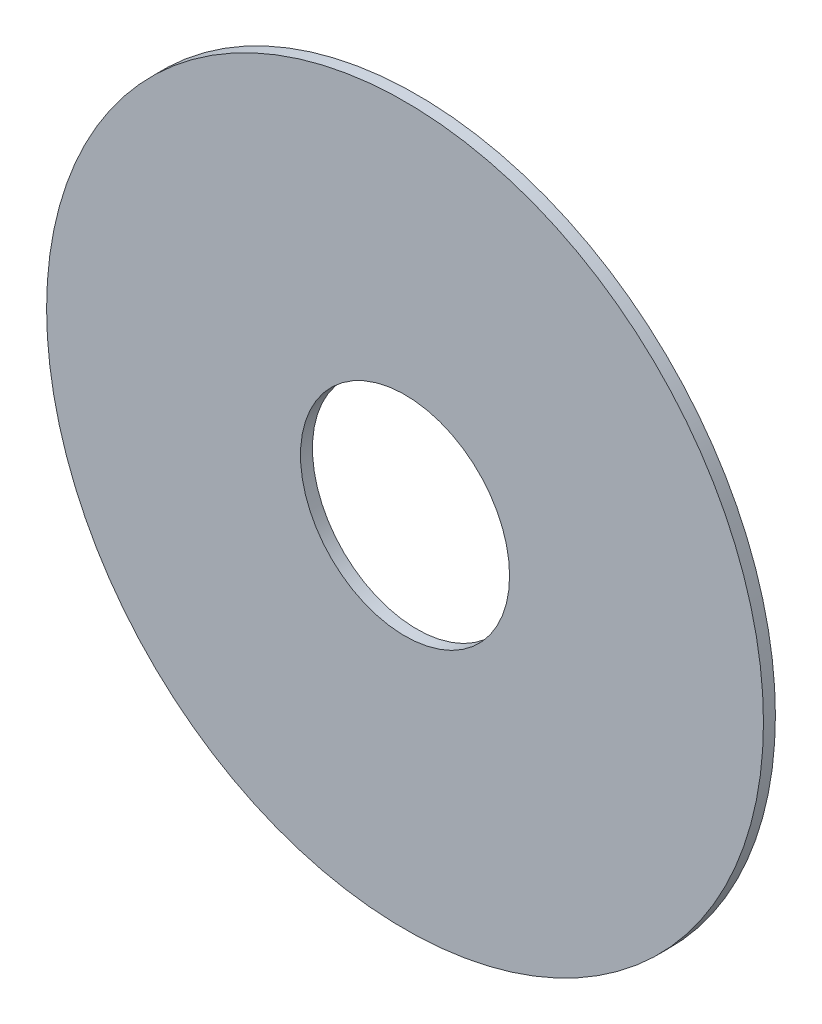
ISO-10303-21;
HEADER;
FILE_DESCRIPTION(('STEP AP214'),'2;1');
FILE_NAME('part.step','',(''),(''),'','','');
FILE_SCHEMA(('AUTOMOTIVE_DESIGN { 1 0 10303 214 1 1 1 1 }'));
ENDSEC;
DATA;
#1=APPLICATION_CONTEXT('core data for automotive mechanical design processes');
#2=APPLICATION_PROTOCOL_DEFINITION('international standard','automotive_design',2000,#1);
#3=PRODUCT_CONTEXT('',#1,'mechanical');
#4=PRODUCT('Part','Part','',(#3));
#5=PRODUCT_RELATED_PRODUCT_CATEGORY('part','',(#4));
#6=PRODUCT_DEFINITION_FORMATION('','',#4);
#7=PRODUCT_DEFINITION_CONTEXT('part definition',#1,'design');
#8=PRODUCT_DEFINITION('design','',#6,#7);
#9=PRODUCT_DEFINITION_SHAPE('','',#8);
#10=(LENGTH_UNIT() NAMED_UNIT(*) SI_UNIT(.MILLI.,.METRE.));
#11=(NAMED_UNIT(*) PLANE_ANGLE_UNIT() SI_UNIT($,.RADIAN.));
#12=(NAMED_UNIT(*) SI_UNIT($,.STERADIAN.) SOLID_ANGLE_UNIT());
#13=UNCERTAINTY_MEASURE_WITH_UNIT(LENGTH_MEASURE(1.E-05),#10,'distance_accuracy_value','');
#14=(GEOMETRIC_REPRESENTATION_CONTEXT(3) GLOBAL_UNCERTAINTY_ASSIGNED_CONTEXT((#13)) GLOBAL_UNIT_ASSIGNED_CONTEXT((#10,
#11,#12)) REPRESENTATION_CONTEXT('',''));
#15=CARTESIAN_POINT('',(0.,0.,0.));
#16=DIRECTION('',(0.,0.,1.));
#17=DIRECTION('',(1.,0.,0.));
#18=AXIS2_PLACEMENT_3D('',#15,#16,#17);
#19=CARTESIAN_POINT('',(0.,0.,0.508));
#20=DIRECTION('',(0.,0.,-1.));
#21=DIRECTION('',(-1.,0.,0.));
#22=AXIS2_PLACEMENT_3D('',#19,#20,#21);
#23=CYLINDRICAL_SURFACE('',#22,15.24);
#24=CARTESIAN_POINT('',(0.,0.,0.508));
#25=DIRECTION('',(0.,0.,1.));
#26=DIRECTION('',(1.,0.,0.));
#27=AXIS2_PLACEMENT_3D('',#24,#25,#26);
#28=CIRCLE('',#27,15.24);
#29=CARTESIAN_POINT('',(15.24,0.,0.508));
#30=VERTEX_POINT('',#29);
#31=EDGE_CURVE('E10',#30,#30,#28,.T.);
#32=ORIENTED_EDGE('',*,*,#31,.F.);
#33=EDGE_LOOP('',(#32));
#34=FACE_BOUND('',#33,.T.);
#35=CARTESIAN_POINT('',(0.,0.,0.));
#36=DIRECTION('',(0.,0.,1.));
#37=DIRECTION('',(1.,0.,0.));
#38=AXIS2_PLACEMENT_3D('',#35,#36,#37);
#39=CIRCLE('',#38,15.24);
#40=CARTESIAN_POINT('',(15.24,0.,0.));
#41=VERTEX_POINT('',#40);
#42=EDGE_CURVE('E36',#41,#41,#39,.T.);
#43=ORIENTED_EDGE('',*,*,#42,.T.);
#44=EDGE_LOOP('',(#43));
#45=FACE_BOUND('',#44,.T.);
#46=ADVANCED_FACE('F33',(#34,#45),#23,.T.);
#47=CARTESIAN_POINT('',(0.,0.,0.508));
#48=DIRECTION('',(0.,0.,1.));
#49=DIRECTION('',(1.,0.,0.));
#50=AXIS2_PLACEMENT_3D('',#47,#48,#49);
#51=PLANE('',#50);
#52=CARTESIAN_POINT('',(0.,0.,0.508));
#53=DIRECTION('',(0.,0.,1.));
#54=DIRECTION('',(1.,0.,0.));
#55=AXIS2_PLACEMENT_3D('',#52,#53,#54);
#56=CIRCLE('',#55,4.445);
#57=CARTESIAN_POINT('',(4.445,0.,0.508));
#58=VERTEX_POINT('',#57);
#59=EDGE_CURVE('E45',#58,#58,#56,.T.);
#60=ORIENTED_EDGE('',*,*,#59,.F.);
#61=EDGE_LOOP('',(#60));
#62=FACE_BOUND('',#61,.T.);
#63=ORIENTED_EDGE('',*,*,#31,.T.);
#64=EDGE_LOOP('',(#63));
#65=FACE_BOUND('',#64,.T.);
#66=ADVANCED_FACE('F60',(#62,#65),#51,.T.);
#67=CARTESIAN_POINT('',(0.,0.,0.));
#68=DIRECTION('',(0.,0.,1.));
#69=DIRECTION('',(1.,0.,0.));
#70=AXIS2_PLACEMENT_3D('',#67,#68,#69);
#71=PLANE('',#70);
#72=CARTESIAN_POINT('',(0.,0.,0.));
#73=DIRECTION('',(0.,0.,1.));
#74=DIRECTION('',(1.,0.,0.));
#75=AXIS2_PLACEMENT_3D('',#72,#73,#74);
#76=CIRCLE('',#75,4.445);
#77=CARTESIAN_POINT('',(4.445,0.,0.));
#78=VERTEX_POINT('',#77);
#79=EDGE_CURVE('E43',#78,#78,#76,.T.);
#80=ORIENTED_EDGE('',*,*,#79,.T.);
#81=EDGE_LOOP('',(#80));
#82=FACE_BOUND('',#81,.T.);
#83=ORIENTED_EDGE('',*,*,#42,.F.);
#84=EDGE_LOOP('',(#83));
#85=FACE_BOUND('',#84,.T.);
#86=ADVANCED_FACE('F51',(#82,#85),#71,.F.);
#87=CARTESIAN_POINT('',(0.,0.,0.));
#88=DIRECTION('',(0.,0.,1.));
#89=DIRECTION('',(1.,0.,0.));
#90=AXIS2_PLACEMENT_3D('',#87,#88,#89);
#91=CYLINDRICAL_SURFACE('',#90,4.445);
#92=ORIENTED_EDGE('',*,*,#79,.F.);
#93=EDGE_LOOP('',(#92));
#94=FACE_BOUND('',#93,.T.);
#95=ORIENTED_EDGE('',*,*,#59,.T.);
#96=EDGE_LOOP('',(#95));
#97=FACE_BOUND('',#96,.T.);
#98=ADVANCED_FACE('F54',(#94,#97),#91,.F.);
#99=CLOSED_SHELL('',(#46,#66,#86,#98));
#100=MANIFOLD_SOLID_BREP('B2',#99);
#101=ADVANCED_BREP_SHAPE_REPRESENTATION('',(#18,#100),#14);
#102=SHAPE_DEFINITION_REPRESENTATION(#9,#101);
ENDSEC;
END-ISO-10303-21;
